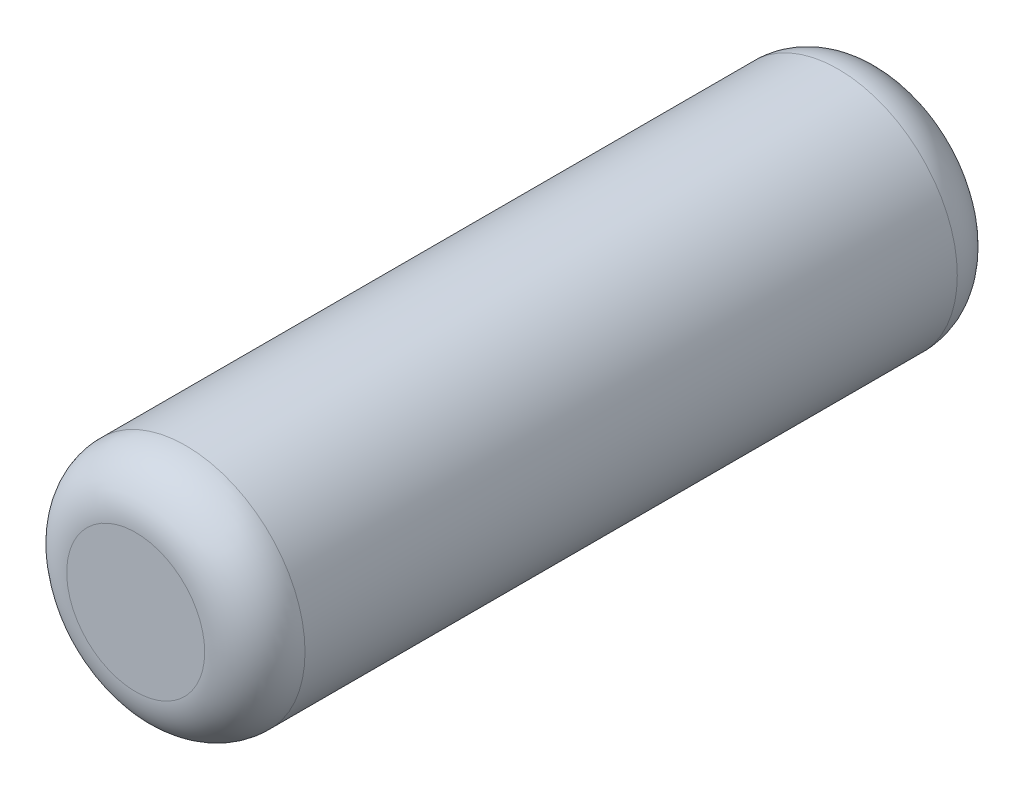
ISO-10303-21;
HEADER;
FILE_DESCRIPTION(('STEP AP214'),'2;1');
FILE_NAME('part.step','',(''),(''),'','','');
FILE_SCHEMA(('AUTOMOTIVE_DESIGN { 1 0 10303 214 1 1 1 1 }'));
ENDSEC;
DATA;
#1=APPLICATION_CONTEXT('core data for automotive mechanical design processes');
#2=APPLICATION_PROTOCOL_DEFINITION('international standard','automotive_design',2000,#1);
#3=PRODUCT_CONTEXT('',#1,'mechanical');
#4=PRODUCT('Part','Part','',(#3));
#5=PRODUCT_RELATED_PRODUCT_CATEGORY('part','',(#4));
#6=PRODUCT_DEFINITION_FORMATION('','',#4);
#7=PRODUCT_DEFINITION_CONTEXT('part definition',#1,'design');
#8=PRODUCT_DEFINITION('design','',#6,#7);
#9=PRODUCT_DEFINITION_SHAPE('','',#8);
#10=(LENGTH_UNIT() NAMED_UNIT(*) SI_UNIT(.MILLI.,.METRE.));
#11=(NAMED_UNIT(*) PLANE_ANGLE_UNIT() SI_UNIT($,.RADIAN.));
#12=(NAMED_UNIT(*) SI_UNIT($,.STERADIAN.) SOLID_ANGLE_UNIT());
#13=UNCERTAINTY_MEASURE_WITH_UNIT(LENGTH_MEASURE(1.E-05),#10,'distance_accuracy_value','');
#14=(GEOMETRIC_REPRESENTATION_CONTEXT(3) GLOBAL_UNCERTAINTY_ASSIGNED_CONTEXT((#13)) GLOBAL_UNIT_ASSIGNED_CONTEXT((#10,
#11,#12)) REPRESENTATION_CONTEXT('',''));
#15=CARTESIAN_POINT('',(0.,0.,0.));
#16=DIRECTION('',(0.,0.,1.));
#17=DIRECTION('',(1.,0.,0.));
#18=AXIS2_PLACEMENT_3D('',#15,#16,#17);
#19=CARTESIAN_POINT('',(0.,0.,762.));
#20=DIRECTION('',(0.,0.,-1.));
#21=DIRECTION('',(-1.,0.,0.));
#22=AXIS2_PLACEMENT_3D('',#19,#20,#21);
#23=CYLINDRICAL_SURFACE('',#22,120.65);
#24=CARTESIAN_POINT('',(0.,0.,50.8));
#25=DIRECTION('',(0.,0.,1.));
#26=DIRECTION('',(1.,0.,0.));
#27=AXIS2_PLACEMENT_3D('',#24,#25,#26);
#28=CIRCLE('',#27,120.65);
#29=CARTESIAN_POINT('',(120.65,0.,50.8));
#30=VERTEX_POINT('',#29);
#31=EDGE_CURVE('E51',#30,#30,#28,.T.);
#32=ORIENTED_EDGE('',*,*,#31,.T.);
#33=EDGE_LOOP('',(#32));
#34=FACE_BOUND('',#33,.T.);
#35=CARTESIAN_POINT('',(0.,0.,711.2));
#36=DIRECTION('',(0.,0.,1.));
#37=DIRECTION('',(1.,0.,0.));
#38=AXIS2_PLACEMENT_3D('',#35,#36,#37);
#39=CIRCLE('',#38,120.65);
#40=CARTESIAN_POINT('',(120.65,0.,711.2));
#41=VERTEX_POINT('',#40);
#42=EDGE_CURVE('E56',#41,#41,#39,.F.);
#43=ORIENTED_EDGE('',*,*,#42,.T.);
#44=EDGE_LOOP('',(#43));
#45=FACE_BOUND('',#44,.T.);
#46=ADVANCED_FACE('F38',(#34,#45),#23,.T.);
#47=CARTESIAN_POINT('',(0.,0.,762.));
#48=DIRECTION('',(0.,0.,1.));
#49=DIRECTION('',(1.,0.,0.));
#50=AXIS2_PLACEMENT_3D('',#47,#48,#49);
#51=PLANE('',#50);
#52=CARTESIAN_POINT('',(0.,0.,762.));
#53=DIRECTION('',(0.,0.,1.));
#54=DIRECTION('',(1.,0.,0.));
#55=AXIS2_PLACEMENT_3D('',#52,#53,#54);
#56=CIRCLE('',#55,69.85);
#57=CARTESIAN_POINT('',(69.85,0.,762.));
#58=VERTEX_POINT('',#57);
#59=EDGE_CURVE('E10',#58,#58,#56,.T.);
#60=ORIENTED_EDGE('',*,*,#59,.T.);
#61=EDGE_LOOP('',(#60));
#62=FACE_BOUND('',#61,.T.);
#63=ADVANCED_FACE('F89',(#62),#51,.T.);
#64=CARTESIAN_POINT('',(0.,0.,0.));
#65=DIRECTION('',(0.,0.,1.));
#66=DIRECTION('',(1.,0.,0.));
#67=AXIS2_PLACEMENT_3D('',#64,#65,#66);
#68=PLANE('',#67);
#69=CARTESIAN_POINT('',(0.,0.,0.));
#70=DIRECTION('',(0.,0.,1.));
#71=DIRECTION('',(1.,0.,0.));
#72=AXIS2_PLACEMENT_3D('',#69,#70,#71);
#73=CIRCLE('',#72,69.85);
#74=CARTESIAN_POINT('',(69.85,0.,0.));
#75=VERTEX_POINT('',#74);
#76=EDGE_CURVE('E46',#75,#75,#73,.F.);
#77=ORIENTED_EDGE('',*,*,#76,.T.);
#78=EDGE_LOOP('',(#77));
#79=FACE_BOUND('',#78,.T.);
#80=ADVANCED_FACE('F92',(#79),#68,.F.);
#81=CARTESIAN_POINT('',(0.,0.,50.8));
#82=DIRECTION('',(0.,0.,1.));
#83=DIRECTION('',(1.,0.,0.));
#84=AXIS2_PLACEMENT_3D('',#81,#82,#83);
#85=TOROIDAL_SURFACE('',#84,69.85,50.8);
#86=ORIENTED_EDGE('',*,*,#76,.F.);
#87=EDGE_LOOP('',(#86));
#88=FACE_BOUND('',#87,.T.);
#89=ORIENTED_EDGE('',*,*,#31,.F.);
#90=EDGE_LOOP('',(#89));
#91=FACE_BOUND('',#90,.T.);
#92=ADVANCED_FACE('F95',(#88,#91),#85,.T.);
#93=CARTESIAN_POINT('',(0.,0.,711.2));
#94=DIRECTION('',(0.,0.,1.));
#95=DIRECTION('',(1.,0.,0.));
#96=AXIS2_PLACEMENT_3D('',#93,#94,#95);
#97=TOROIDAL_SURFACE('',#96,69.85,50.8);
#98=ORIENTED_EDGE('',*,*,#42,.F.);
#99=EDGE_LOOP('',(#98));
#100=FACE_BOUND('',#99,.T.);
#101=ORIENTED_EDGE('',*,*,#59,.F.);
#102=EDGE_LOOP('',(#101));
#103=FACE_BOUND('',#102,.T.);
#104=ADVANCED_FACE('F40',(#100,#103),#97,.T.);
#105=CLOSED_SHELL('',(#46,#63,#80,#92,#104));
#106=CARTESIAN_POINT('',(0.,0.,25.4000000000001));
#107=DIRECTION('',(0.,0.,1.));
#108=DIRECTION('',(1.,0.,0.));
#109=AXIS2_PLACEMENT_3D('',#106,#107,#108);
#110=CYLINDRICAL_SURFACE('',#109,101.6);
#111=CARTESIAN_POINT('',(0.,0.,25.4000000000001));
#112=DIRECTION('',(0.,0.,1.));
#113=DIRECTION('',(1.,0.,0.));
#114=AXIS2_PLACEMENT_3D('',#111,#112,#113);
#115=CIRCLE('',#114,101.6);
#116=CARTESIAN_POINT('',(101.6,0.,25.4000000000001));
#117=VERTEX_POINT('',#116);
#118=EDGE_CURVE('E62',#117,#117,#115,.T.);
#119=ORIENTED_EDGE('',*,*,#118,.F.);
#120=EDGE_LOOP('',(#119));
#121=FACE_BOUND('',#120,.T.);
#122=CARTESIAN_POINT('',(0.,0.,736.6));
#123=DIRECTION('',(0.,0.,1.));
#124=DIRECTION('',(1.,0.,0.));
#125=AXIS2_PLACEMENT_3D('',#122,#123,#124);
#126=CIRCLE('',#125,101.6);
#127=CARTESIAN_POINT('',(101.6,0.,736.6));
#128=VERTEX_POINT('',#127);
#129=EDGE_CURVE('E63',#128,#128,#126,.T.);
#130=ORIENTED_EDGE('',*,*,#129,.T.);
#131=EDGE_LOOP('',(#130));
#132=FACE_BOUND('',#131,.T.);
#133=ADVANCED_FACE('F73',(#121,#132),#110,.F.);
#134=CARTESIAN_POINT('',(0.,0.,25.4000000000001));
#135=DIRECTION('',(0.,0.,1.));
#136=DIRECTION('',(1.,0.,0.));
#137=AXIS2_PLACEMENT_3D('',#134,#135,#136);
#138=PLANE('',#137);
#139=ORIENTED_EDGE('',*,*,#118,.T.);
#140=EDGE_LOOP('',(#139));
#141=FACE_BOUND('',#140,.T.);
#142=ADVANCED_FACE('F71',(#141),#138,.T.);
#143=CARTESIAN_POINT('',(0.,0.,736.6));
#144=DIRECTION('',(0.,0.,1.));
#145=DIRECTION('',(1.,0.,0.));
#146=AXIS2_PLACEMENT_3D('',#143,#144,#145);
#147=PLANE('',#146);
#148=ORIENTED_EDGE('',*,*,#129,.F.);
#149=EDGE_LOOP('',(#148));
#150=FACE_BOUND('',#149,.T.);
#151=ADVANCED_FACE('F80',(#150),#147,.F.);
#152=CLOSED_SHELL('',(#133,#142,#151));
#153=ORIENTED_CLOSED_SHELL('',*,#152,.T.);
#154=BREP_WITH_VOIDS('B2',#105,(#153));
#155=ADVANCED_BREP_SHAPE_REPRESENTATION('',(#18,#154),#14);
#156=SHAPE_DEFINITION_REPRESENTATION(#9,#155);
ENDSEC;
END-ISO-10303-21;
